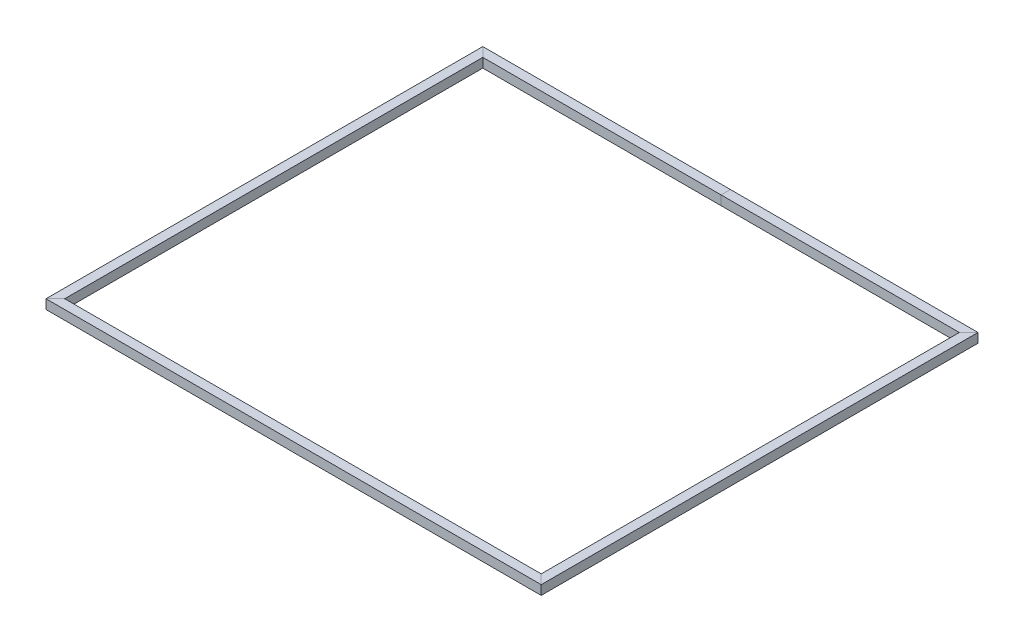
ISO-10303-21;
HEADER;
FILE_DESCRIPTION(('STEP AP214'),'2;1');
FILE_NAME('part.step','',(''),(''),'','','');
FILE_SCHEMA(('AUTOMOTIVE_DESIGN { 1 0 10303 214 1 1 1 1 }'));
ENDSEC;
DATA;
#1=APPLICATION_CONTEXT('core data for automotive mechanical design processes');
#2=APPLICATION_PROTOCOL_DEFINITION('international standard','automotive_design',2000,#1);
#3=PRODUCT_CONTEXT('',#1,'mechanical');
#4=PRODUCT('Part','Part','',(#3));
#5=PRODUCT_RELATED_PRODUCT_CATEGORY('part','',(#4));
#6=PRODUCT_DEFINITION_FORMATION('','',#4);
#7=PRODUCT_DEFINITION_CONTEXT('part definition',#1,'design');
#8=PRODUCT_DEFINITION('design','',#6,#7);
#9=PRODUCT_DEFINITION_SHAPE('','',#8);
#10=(LENGTH_UNIT() NAMED_UNIT(*) SI_UNIT(.MILLI.,.METRE.));
#11=(NAMED_UNIT(*) PLANE_ANGLE_UNIT() SI_UNIT($,.RADIAN.));
#12=(NAMED_UNIT(*) SI_UNIT($,.STERADIAN.) SOLID_ANGLE_UNIT());
#13=UNCERTAINTY_MEASURE_WITH_UNIT(LENGTH_MEASURE(1.E-05),#10,'distance_accuracy_value','');
#14=(GEOMETRIC_REPRESENTATION_CONTEXT(3) GLOBAL_UNCERTAINTY_ASSIGNED_CONTEXT((#13)) GLOBAL_UNIT_ASSIGNED_CONTEXT((#10,
#11,#12)) REPRESENTATION_CONTEXT('',''));
#15=CARTESIAN_POINT('',(0.,0.,0.));
#16=DIRECTION('',(0.,0.,1.));
#17=DIRECTION('',(1.,0.,0.));
#18=AXIS2_PLACEMENT_3D('',#15,#16,#17);
#19=CARTESIAN_POINT('',(1295.4,25.3999999999998,1190.09));
#20=DIRECTION('',(0.,-1.,0.));
#21=DIRECTION('',(1.,0.,0.));
#22=AXIS2_PLACEMENT_3D('',#19,#20,#21);
#23=PLANE('',#22);
#24=DIRECTION('',(0.,0.,-1.));
#25=VECTOR('',#24,1.);
#26=CARTESIAN_POINT('',(1295.4,25.3999999999998,1190.09));
#27=LINE('',#26,#25);
#28=CARTESIAN_POINT('',(1295.4,25.3999999999998,1136.65));
#29=VERTEX_POINT('',#28);
#30=CARTESIAN_POINT('',(1295.4,25.3999999999998,-1136.65));
#31=VERTEX_POINT('',#30);
#32=EDGE_CURVE('E37',#29,#31,#27,.T.);
#33=ORIENTED_EDGE('',*,*,#32,.F.);
#34=DIRECTION('',(0.707106781186548,0.,0.707106781186548));
#35=VECTOR('',#34,1.);
#36=CARTESIAN_POINT('',(-26.7199999999999,25.4,-185.47));
#37=LINE('',#36,#35);
#38=CARTESIAN_POINT('',(1346.2,25.3999999999998,1187.45));
#39=VERTEX_POINT('',#38);
#40=EDGE_CURVE('E238',#29,#39,#37,.T.);
#41=ORIENTED_EDGE('',*,*,#40,.T.);
#42=DIRECTION('',(0.,0.,-1.));
#43=VECTOR('',#42,1.);
#44=CARTESIAN_POINT('',(1346.2,25.3999999999998,1190.09));
#45=LINE('',#44,#43);
#46=CARTESIAN_POINT('',(1346.2,25.3999999999998,-1187.45));
#47=VERTEX_POINT('',#46);
#48=EDGE_CURVE('E224',#39,#47,#45,.T.);
#49=ORIENTED_EDGE('',*,*,#48,.T.);
#50=DIRECTION('',(0.707106781186547,0.,-0.707106781186548));
#51=VECTOR('',#50,1.);
#52=CARTESIAN_POINT('',(1322.12,25.3999999999998,-1163.37));
#53=LINE('',#52,#51);
#54=EDGE_CURVE('E154',#31,#47,#53,.T.);
#55=ORIENTED_EDGE('',*,*,#54,.F.);
#56=EDGE_LOOP('',(#33,#41,#49,#55));
#57=FACE_BOUND('',#56,.T.);
#58=ADVANCED_FACE('F34',(#57),#23,.F.);
#59=CARTESIAN_POINT('',(1346.2,25.3999999999998,1190.09));
#60=DIRECTION('',(-1.,0.,0.));
#61=DIRECTION('',(0.,0.,1.));
#62=AXIS2_PLACEMENT_3D('',#59,#60,#61);
#63=PLANE('',#62);
#64=ORIENTED_EDGE('',*,*,#48,.F.);
#65=DIRECTION('',(0.,-1.,0.));
#66=VECTOR('',#65,1.);
#67=CARTESIAN_POINT('',(1346.2,25.3999999999998,1187.45));
#68=LINE('',#67,#66);
#69=CARTESIAN_POINT('',(1346.2,-25.4000000000002,1187.45));
#70=VERTEX_POINT('',#69);
#71=EDGE_CURVE('E233',#39,#70,#68,.T.);
#72=ORIENTED_EDGE('',*,*,#71,.T.);
#73=DIRECTION('',(0.,0.,-1.));
#74=VECTOR('',#73,1.);
#75=CARTESIAN_POINT('',(1346.2,-25.4000000000002,1190.09));
#76=LINE('',#75,#74);
#77=CARTESIAN_POINT('',(1346.2,-25.4000000000002,-1187.45));
#78=VERTEX_POINT('',#77);
#79=EDGE_CURVE('E182',#70,#78,#76,.T.);
#80=ORIENTED_EDGE('',*,*,#79,.T.);
#81=DIRECTION('',(0.,-1.,0.));
#82=VECTOR('',#81,1.);
#83=CARTESIAN_POINT('',(1346.2,25.3999999999998,-1187.45));
#84=LINE('',#83,#82);
#85=EDGE_CURVE('E170',#47,#78,#84,.T.);
#86=ORIENTED_EDGE('',*,*,#85,.F.);
#87=EDGE_LOOP('',(#64,#72,#80,#86));
#88=FACE_BOUND('',#87,.T.);
#89=ADVANCED_FACE('F231',(#88),#63,.F.);
#90=CARTESIAN_POINT('',(1295.4,-25.4000000000002,1190.09));
#91=DIRECTION('',(0.,1.,0.));
#92=DIRECTION('',(-1.,0.,0.));
#93=AXIS2_PLACEMENT_3D('',#90,#91,#92);
#94=PLANE('',#93);
#95=ORIENTED_EDGE('',*,*,#79,.F.);
#96=DIRECTION('',(-0.707106781186548,0.,-0.707106781186548));
#97=VECTOR('',#96,1.);
#98=CARTESIAN_POINT('',(-26.7199999999999,-25.3999999999999,-185.47));
#99=LINE('',#98,#97);
#100=CARTESIAN_POINT('',(1295.4,-25.4000000000002,1136.65));
#101=VERTEX_POINT('',#100);
#102=EDGE_CURVE('E178',#70,#101,#99,.T.);
#103=ORIENTED_EDGE('',*,*,#102,.T.);
#104=DIRECTION('',(0.,0.,-1.));
#105=VECTOR('',#104,1.);
#106=CARTESIAN_POINT('',(1295.4,-25.4000000000002,1190.09));
#107=LINE('',#106,#105);
#108=CARTESIAN_POINT('',(1295.4,-25.4000000000002,-1136.65));
#109=VERTEX_POINT('',#108);
#110=EDGE_CURVE('E175',#101,#109,#107,.T.);
#111=ORIENTED_EDGE('',*,*,#110,.T.);
#112=DIRECTION('',(-0.707106781186547,0.,0.707106781186548));
#113=VECTOR('',#112,1.);
#114=CARTESIAN_POINT('',(1322.12,-25.4000000000002,-1163.37));
#115=LINE('',#114,#113);
#116=EDGE_CURVE('E160',#78,#109,#115,.T.);
#117=ORIENTED_EDGE('',*,*,#116,.F.);
#118=EDGE_LOOP('',(#95,#103,#111,#117));
#119=FACE_BOUND('',#118,.T.);
#120=ADVANCED_FACE('F177',(#119),#94,.F.);
#121=CARTESIAN_POINT('',(1295.4,25.3999999999998,1190.09));
#122=DIRECTION('',(1.,0.,0.));
#123=DIRECTION('',(0.,0.,-1.));
#124=AXIS2_PLACEMENT_3D('',#121,#122,#123);
#125=PLANE('',#124);
#126=ORIENTED_EDGE('',*,*,#110,.F.);
#127=DIRECTION('',(0.,1.,0.));
#128=VECTOR('',#127,1.);
#129=CARTESIAN_POINT('',(1295.4,25.3999999999998,1136.65));
#130=LINE('',#129,#128);
#131=EDGE_CURVE('E257',#101,#29,#130,.T.);
#132=ORIENTED_EDGE('',*,*,#131,.T.);
#133=ORIENTED_EDGE('',*,*,#32,.T.);
#134=DIRECTION('',(0.,1.,0.));
#135=VECTOR('',#134,1.);
#136=CARTESIAN_POINT('',(1295.4,25.3999999999998,-1136.65));
#137=LINE('',#136,#135);
#138=EDGE_CURVE('E184',#109,#31,#137,.T.);
#139=ORIENTED_EDGE('',*,*,#138,.F.);
#140=EDGE_LOOP('',(#126,#132,#133,#139));
#141=FACE_BOUND('',#140,.T.);
#142=ADVANCED_FACE('F185',(#141),#125,.F.);
#143=CARTESIAN_POINT('',(1348.84,25.3999999999998,-1136.65));
#144=DIRECTION('',(0.,0.,-1.));
#145=DIRECTION('',(-1.,0.,0.));
#146=AXIS2_PLACEMENT_3D('',#143,#144,#145);
#147=PLANE('',#146);
#148=ORIENTED_EDGE('',*,*,#138,.T.);
#149=DIRECTION('',(-1.,0.,0.));
#150=VECTOR('',#149,1.);
#151=CARTESIAN_POINT('',(1348.84,25.3999999999998,-1136.65));
#152=LINE('',#151,#150);
#153=CARTESIAN_POINT('',(0.,25.3999999999998,-1136.65));
#154=VERTEX_POINT('',#153);
#155=EDGE_CURVE('E194',#31,#154,#152,.T.);
#156=ORIENTED_EDGE('',*,*,#155,.T.);
#157=DIRECTION('',(0.,-1.,0.));
#158=VECTOR('',#157,1.);
#159=CARTESIAN_POINT('',(0.,25.3999999999998,-1136.65));
#160=LINE('',#159,#158);
#161=CARTESIAN_POINT('',(0.,-25.4000000000002,-1136.65));
#162=VERTEX_POINT('',#161);
#163=EDGE_CURVE('E193',#154,#162,#160,.T.);
#164=ORIENTED_EDGE('',*,*,#163,.T.);
#165=DIRECTION('',(-1.,0.,0.));
#166=VECTOR('',#165,1.);
#167=CARTESIAN_POINT('',(1348.84,-25.4000000000002,-1136.65));
#168=LINE('',#167,#166);
#169=EDGE_CURVE('E165',#109,#162,#168,.T.);
#170=ORIENTED_EDGE('',*,*,#169,.F.);
#171=EDGE_LOOP('',(#148,#156,#164,#170));
#172=FACE_BOUND('',#171,.T.);
#173=ADVANCED_FACE('F191',(#172),#147,.F.);
#174=CARTESIAN_POINT('',(1348.84,-25.4000000000002,-1136.65));
#175=DIRECTION('',(0.,1.,0.));
#176=DIRECTION('',(0.,0.,1.));
#177=AXIS2_PLACEMENT_3D('',#174,#175,#176);
#178=PLANE('',#177);
#179=ORIENTED_EDGE('',*,*,#116,.T.);
#180=ORIENTED_EDGE('',*,*,#169,.T.);
#181=DIRECTION('',(0.,0.,-1.));
#182=VECTOR('',#181,1.);
#183=CARTESIAN_POINT('',(0.,-25.4000000000002,-1136.65));
#184=LINE('',#183,#182);
#185=CARTESIAN_POINT('',(0.,-25.4000000000002,-1187.45));
#186=VERTEX_POINT('',#185);
#187=EDGE_CURVE('E205',#162,#186,#184,.T.);
#188=ORIENTED_EDGE('',*,*,#187,.T.);
#189=DIRECTION('',(-1.,0.,0.));
#190=VECTOR('',#189,1.);
#191=CARTESIAN_POINT('',(1348.84,-25.4000000000002,-1187.45));
#192=LINE('',#191,#190);
#193=EDGE_CURVE('E167',#78,#186,#192,.T.);
#194=ORIENTED_EDGE('',*,*,#193,.F.);
#195=EDGE_LOOP('',(#179,#180,#188,#194));
#196=FACE_BOUND('',#195,.T.);
#197=ADVANCED_FACE('F162',(#196),#178,.F.);
#198=CARTESIAN_POINT('',(1348.84,25.3999999999998,-1187.45));
#199=DIRECTION('',(0.,0.,1.));
#200=DIRECTION('',(1.,0.,0.));
#201=AXIS2_PLACEMENT_3D('',#198,#199,#200);
#202=PLANE('',#201);
#203=ORIENTED_EDGE('',*,*,#85,.T.);
#204=ORIENTED_EDGE('',*,*,#193,.T.);
#205=DIRECTION('',(0.,1.,0.));
#206=VECTOR('',#205,1.);
#207=CARTESIAN_POINT('',(0.,25.3999999999998,-1187.45));
#208=LINE('',#207,#206);
#209=CARTESIAN_POINT('',(0.,25.3999999999998,-1187.45));
#210=VERTEX_POINT('',#209);
#211=EDGE_CURVE('E207',#186,#210,#208,.T.);
#212=ORIENTED_EDGE('',*,*,#211,.T.);
#213=DIRECTION('',(-1.,0.,0.));
#214=VECTOR('',#213,1.);
#215=CARTESIAN_POINT('',(1348.84,25.3999999999998,-1187.45));
#216=LINE('',#215,#214);
#217=EDGE_CURVE('E196',#47,#210,#216,.T.);
#218=ORIENTED_EDGE('',*,*,#217,.F.);
#219=EDGE_LOOP('',(#203,#204,#212,#218));
#220=FACE_BOUND('',#219,.T.);
#221=ADVANCED_FACE('F526',(#220),#202,.F.);
#222=CARTESIAN_POINT('',(1348.84,25.3999999999998,-1136.65));
#223=DIRECTION('',(0.,-1.,0.));
#224=DIRECTION('',(0.,0.,-1.));
#225=AXIS2_PLACEMENT_3D('',#222,#223,#224);
#226=PLANE('',#225);
#227=ORIENTED_EDGE('',*,*,#54,.T.);
#228=ORIENTED_EDGE('',*,*,#217,.T.);
#229=DIRECTION('',(0.,0.,1.));
#230=VECTOR('',#229,1.);
#231=CARTESIAN_POINT('',(0.,25.3999999999998,-1136.65));
#232=LINE('',#231,#230);
#233=EDGE_CURVE('E210',#210,#154,#232,.T.);
#234=ORIENTED_EDGE('',*,*,#233,.T.);
#235=ORIENTED_EDGE('',*,*,#155,.F.);
#236=EDGE_LOOP('',(#227,#228,#234,#235));
#237=FACE_BOUND('',#236,.T.);
#238=ADVANCED_FACE('F522',(#237),#226,.F.);
#239=CARTESIAN_POINT('',(0.,25.3999999999998,-1136.65));
#240=DIRECTION('',(0.,0.,-1.));
#241=DIRECTION('',(-1.,0.,0.));
#242=AXIS2_PLACEMENT_3D('',#239,#240,#241);
#243=PLANE('',#242);
#244=DIRECTION('',(-1.,0.,0.));
#245=VECTOR('',#244,1.);
#246=CARTESIAN_POINT('',(0.,-25.4000000000002,-1136.65));
#247=LINE('',#246,#245);
#248=CARTESIAN_POINT('',(-1295.4,-25.4000000000002,-1136.65));
#249=VERTEX_POINT('',#248);
#250=EDGE_CURVE('E216',#162,#249,#247,.T.);
#251=ORIENTED_EDGE('',*,*,#250,.F.);
#252=ORIENTED_EDGE('',*,*,#163,.F.);
#253=DIRECTION('',(-1.,0.,0.));
#254=VECTOR('',#253,1.);
#255=CARTESIAN_POINT('',(0.,25.3999999999998,-1136.65));
#256=LINE('',#255,#254);
#257=CARTESIAN_POINT('',(-1295.4,25.3999999999998,-1136.65));
#258=VERTEX_POINT('',#257);
#259=EDGE_CURVE('E213',#154,#258,#256,.T.);
#260=ORIENTED_EDGE('',*,*,#259,.T.);
#261=DIRECTION('',(0.,1.,0.));
#262=VECTOR('',#261,1.);
#263=CARTESIAN_POINT('',(-1295.4,25.3999999999998,-1136.65));
#264=LINE('',#263,#262);
#265=EDGE_CURVE('E276',#249,#258,#264,.T.);
#266=ORIENTED_EDGE('',*,*,#265,.F.);
#267=EDGE_LOOP('',(#251,#252,#260,#266));
#268=FACE_BOUND('',#267,.T.);
#269=ADVANCED_FACE('F525',(#268),#243,.F.);
#270=CARTESIAN_POINT('',(0.,-25.4000000000002,-1136.65));
#271=DIRECTION('',(0.,1.,0.));
#272=DIRECTION('',(0.,0.,1.));
#273=AXIS2_PLACEMENT_3D('',#270,#271,#272);
#274=PLANE('',#273);
#275=DIRECTION('',(-1.,0.,0.));
#276=VECTOR('',#275,1.);
#277=CARTESIAN_POINT('',(0.,-25.4000000000002,-1187.45));
#278=LINE('',#277,#276);
#279=CARTESIAN_POINT('',(-1346.2,-25.4000000000002,-1187.45));
#280=VERTEX_POINT('',#279);
#281=EDGE_CURVE('E219',#186,#280,#278,.T.);
#282=ORIENTED_EDGE('',*,*,#281,.F.);
#283=ORIENTED_EDGE('',*,*,#187,.F.);
#284=ORIENTED_EDGE('',*,*,#250,.T.);
#285=DIRECTION('',(0.707106781186548,0.,0.707106781186548));
#286=VECTOR('',#285,1.);
#287=CARTESIAN_POINT('',(-1322.12,-25.4000000000002,-1163.37));
#288=LINE('',#287,#286);
#289=EDGE_CURVE('E280',#280,#249,#288,.T.);
#290=ORIENTED_EDGE('',*,*,#289,.F.);
#291=EDGE_LOOP('',(#282,#283,#284,#290));
#292=FACE_BOUND('',#291,.T.);
#293=ADVANCED_FACE('F536',(#292),#274,.F.);
#294=CARTESIAN_POINT('',(0.,25.3999999999998,-1187.45));
#295=DIRECTION('',(0.,0.,1.));
#296=DIRECTION('',(1.,0.,0.));
#297=AXIS2_PLACEMENT_3D('',#294,#295,#296);
#298=PLANE('',#297);
#299=DIRECTION('',(-1.,0.,0.));
#300=VECTOR('',#299,1.);
#301=CARTESIAN_POINT('',(0.,25.3999999999998,-1187.45));
#302=LINE('',#301,#300);
#303=CARTESIAN_POINT('',(-1346.2,25.3999999999998,-1187.45));
#304=VERTEX_POINT('',#303);
#305=EDGE_CURVE('E171',#210,#304,#302,.T.);
#306=ORIENTED_EDGE('',*,*,#305,.F.);
#307=ORIENTED_EDGE('',*,*,#211,.F.);
#308=ORIENTED_EDGE('',*,*,#281,.T.);
#309=DIRECTION('',(0.,-1.,0.));
#310=VECTOR('',#309,1.);
#311=CARTESIAN_POINT('',(-1346.2,25.3999999999998,-1187.45));
#312=LINE('',#311,#310);
#313=EDGE_CURVE('E277',#304,#280,#312,.T.);
#314=ORIENTED_EDGE('',*,*,#313,.F.);
#315=EDGE_LOOP('',(#306,#307,#308,#314));
#316=FACE_BOUND('',#315,.T.);
#317=ADVANCED_FACE('F540',(#316),#298,.F.);
#318=CARTESIAN_POINT('',(0.,25.3999999999998,-1136.65));
#319=DIRECTION('',(0.,-1.,0.));
#320=DIRECTION('',(0.,0.,-1.));
#321=AXIS2_PLACEMENT_3D('',#318,#319,#320);
#322=PLANE('',#321);
#323=ORIENTED_EDGE('',*,*,#259,.F.);
#324=ORIENTED_EDGE('',*,*,#233,.F.);
#325=ORIENTED_EDGE('',*,*,#305,.T.);
#326=DIRECTION('',(-0.707106781186548,0.,-0.707106781186548));
#327=VECTOR('',#326,1.);
#328=CARTESIAN_POINT('',(-1322.12,25.3999999999998,-1163.37));
#329=LINE('',#328,#327);
#330=EDGE_CURVE('E261',#258,#304,#329,.T.);
#331=ORIENTED_EDGE('',*,*,#330,.F.);
#332=EDGE_LOOP('',(#323,#324,#325,#331));
#333=FACE_BOUND('',#332,.T.);
#334=ADVANCED_FACE('F520',(#333),#322,.F.);
#335=CARTESIAN_POINT('',(-1348.84,25.3999999999998,1136.65));
#336=DIRECTION('',(0.,-1.,0.));
#337=DIRECTION('',(0.,0.,-1.));
#338=AXIS2_PLACEMENT_3D('',#335,#336,#337);
#339=PLANE('',#338);
#340=DIRECTION('',(1.,0.,0.));
#341=VECTOR('',#340,1.);
#342=CARTESIAN_POINT('',(-1348.84,25.3999999999998,1136.65));
#343=LINE('',#342,#341);
#344=CARTESIAN_POINT('',(-1295.4,25.3999999999998,1136.65));
#345=VERTEX_POINT('',#344);
#346=EDGE_CURVE('E250',#345,#29,#343,.T.);
#347=ORIENTED_EDGE('',*,*,#346,.F.);
#348=DIRECTION('',(-0.707106781186547,0.,0.707106781186548));
#349=VECTOR('',#348,1.);
#350=CARTESIAN_POINT('',(-132.03,25.4,-26.7199999999999));
#351=LINE('',#350,#349);
#352=CARTESIAN_POINT('',(-1346.2,25.3999999999998,1187.45));
#353=VERTEX_POINT('',#352);
#354=EDGE_CURVE('E285',#345,#353,#351,.T.);
#355=ORIENTED_EDGE('',*,*,#354,.T.);
#356=DIRECTION('',(1.,0.,0.));
#357=VECTOR('',#356,1.);
#358=CARTESIAN_POINT('',(-1348.84,25.3999999999998,1187.45));
#359=LINE('',#358,#357);
#360=EDGE_CURVE('E188',#353,#39,#359,.T.);
#361=ORIENTED_EDGE('',*,*,#360,.T.);
#362=ORIENTED_EDGE('',*,*,#40,.F.);
#363=EDGE_LOOP('',(#347,#355,#361,#362));
#364=FACE_BOUND('',#363,.T.);
#365=ADVANCED_FACE('F517',(#364),#339,.F.);
#366=CARTESIAN_POINT('',(-1348.84,25.3999999999998,1187.45));
#367=DIRECTION('',(0.,0.,-1.));
#368=DIRECTION('',(-1.,0.,0.));
#369=AXIS2_PLACEMENT_3D('',#366,#367,#368);
#370=PLANE('',#369);
#371=ORIENTED_EDGE('',*,*,#360,.F.);
#372=DIRECTION('',(0.,-1.,0.));
#373=VECTOR('',#372,1.);
#374=CARTESIAN_POINT('',(-1346.2,25.3999999999998,1187.45));
#375=LINE('',#374,#373);
#376=CARTESIAN_POINT('',(-1346.2,-25.4000000000002,1187.45));
#377=VERTEX_POINT('',#376);
#378=EDGE_CURVE('E244',#353,#377,#375,.T.);
#379=ORIENTED_EDGE('',*,*,#378,.T.);
#380=DIRECTION('',(1.,0.,0.));
#381=VECTOR('',#380,1.);
#382=CARTESIAN_POINT('',(-1348.84,-25.4000000000002,1187.45));
#383=LINE('',#382,#381);
#384=EDGE_CURVE('E242',#377,#70,#383,.T.);
#385=ORIENTED_EDGE('',*,*,#384,.T.);
#386=ORIENTED_EDGE('',*,*,#71,.F.);
#387=EDGE_LOOP('',(#371,#379,#385,#386));
#388=FACE_BOUND('',#387,.T.);
#389=ADVANCED_FACE('F243',(#388),#370,.F.);
#390=CARTESIAN_POINT('',(-1348.84,-25.4000000000002,1136.65));
#391=DIRECTION('',(0.,1.,0.));
#392=DIRECTION('',(0.,0.,1.));
#393=AXIS2_PLACEMENT_3D('',#390,#391,#392);
#394=PLANE('',#393);
#395=ORIENTED_EDGE('',*,*,#384,.F.);
#396=DIRECTION('',(0.707106781186547,0.,-0.707106781186548));
#397=VECTOR('',#396,1.);
#398=CARTESIAN_POINT('',(-132.03,-25.4,-26.7199999999999));
#399=LINE('',#398,#397);
#400=CARTESIAN_POINT('',(-1295.4,-25.4000000000002,1136.65));
#401=VERTEX_POINT('',#400);
#402=EDGE_CURVE('E279',#377,#401,#399,.T.);
#403=ORIENTED_EDGE('',*,*,#402,.T.);
#404=DIRECTION('',(1.,0.,0.));
#405=VECTOR('',#404,1.);
#406=CARTESIAN_POINT('',(-1348.84,-25.4000000000002,1136.65));
#407=LINE('',#406,#405);
#408=EDGE_CURVE('E248',#401,#101,#407,.T.);
#409=ORIENTED_EDGE('',*,*,#408,.T.);
#410=ORIENTED_EDGE('',*,*,#102,.F.);
#411=EDGE_LOOP('',(#395,#403,#409,#410));
#412=FACE_BOUND('',#411,.T.);
#413=ADVANCED_FACE('F511',(#412),#394,.F.);
#414=CARTESIAN_POINT('',(-1348.84,25.3999999999998,1136.65));
#415=DIRECTION('',(0.,0.,1.));
#416=DIRECTION('',(1.,0.,0.));
#417=AXIS2_PLACEMENT_3D('',#414,#415,#416);
#418=PLANE('',#417);
#419=ORIENTED_EDGE('',*,*,#408,.F.);
#420=DIRECTION('',(0.,1.,0.));
#421=VECTOR('',#420,1.);
#422=CARTESIAN_POINT('',(-1295.4,25.3999999999998,1136.65));
#423=LINE('',#422,#421);
#424=EDGE_CURVE('E274',#401,#345,#423,.T.);
#425=ORIENTED_EDGE('',*,*,#424,.T.);
#426=ORIENTED_EDGE('',*,*,#346,.T.);
#427=ORIENTED_EDGE('',*,*,#131,.F.);
#428=EDGE_LOOP('',(#419,#425,#426,#427));
#429=FACE_BOUND('',#428,.T.);
#430=ADVANCED_FACE('F497',(#429),#418,.F.);
#431=CARTESIAN_POINT('',(-1295.4,25.3999999999998,-1190.09));
#432=DIRECTION('',(0.,-1.,0.));
#433=DIRECTION('',(1.,0.,0.));
#434=AXIS2_PLACEMENT_3D('',#431,#432,#433);
#435=PLANE('',#434);
#436=ORIENTED_EDGE('',*,*,#330,.T.);
#437=DIRECTION('',(0.,0.,1.));
#438=VECTOR('',#437,1.);
#439=CARTESIAN_POINT('',(-1346.2,25.3999999999998,-1190.09));
#440=LINE('',#439,#438);
#441=EDGE_CURVE('E271',#304,#353,#440,.T.);
#442=ORIENTED_EDGE('',*,*,#441,.T.);
#443=ORIENTED_EDGE('',*,*,#354,.F.);
#444=DIRECTION('',(0.,0.,1.));
#445=VECTOR('',#444,1.);
#446=CARTESIAN_POINT('',(-1295.4,25.3999999999998,-1190.09));
#447=LINE('',#446,#445);
#448=EDGE_CURVE('E262',#258,#345,#447,.T.);
#449=ORIENTED_EDGE('',*,*,#448,.F.);
#450=EDGE_LOOP('',(#436,#442,#443,#449));
#451=FACE_BOUND('',#450,.T.);
#452=ADVANCED_FACE('F493',(#451),#435,.F.);
#453=CARTESIAN_POINT('',(-1346.2,25.3999999999998,-1190.09));
#454=DIRECTION('',(1.,0.,0.));
#455=DIRECTION('',(0.,0.,-1.));
#456=AXIS2_PLACEMENT_3D('',#453,#454,#455);
#457=PLANE('',#456);
#458=ORIENTED_EDGE('',*,*,#313,.T.);
#459=DIRECTION('',(0.,0.,1.));
#460=VECTOR('',#459,1.);
#461=CARTESIAN_POINT('',(-1346.2,-25.4000000000002,-1190.09));
#462=LINE('',#461,#460);
#463=EDGE_CURVE('E269',#280,#377,#462,.T.);
#464=ORIENTED_EDGE('',*,*,#463,.T.);
#465=ORIENTED_EDGE('',*,*,#378,.F.);
#466=ORIENTED_EDGE('',*,*,#441,.F.);
#467=EDGE_LOOP('',(#458,#464,#465,#466));
#468=FACE_BOUND('',#467,.T.);
#469=ADVANCED_FACE('F496',(#468),#457,.F.);
#470=CARTESIAN_POINT('',(-1295.4,-25.4000000000002,-1190.09));
#471=DIRECTION('',(0.,1.,0.));
#472=DIRECTION('',(-1.,0.,0.));
#473=AXIS2_PLACEMENT_3D('',#470,#471,#472);
#474=PLANE('',#473);
#475=ORIENTED_EDGE('',*,*,#289,.T.);
#476=DIRECTION('',(0.,0.,1.));
#477=VECTOR('',#476,1.);
#478=CARTESIAN_POINT('',(-1295.4,-25.4000000000002,-1190.09));
#479=LINE('',#478,#477);
#480=EDGE_CURVE('E266',#249,#401,#479,.T.);
#481=ORIENTED_EDGE('',*,*,#480,.T.);
#482=ORIENTED_EDGE('',*,*,#402,.F.);
#483=ORIENTED_EDGE('',*,*,#463,.F.);
#484=EDGE_LOOP('',(#475,#481,#482,#483));
#485=FACE_BOUND('',#484,.T.);
#486=ADVANCED_FACE('F501',(#485),#474,.F.);
#487=CARTESIAN_POINT('',(-1295.4,25.3999999999998,-1190.09));
#488=DIRECTION('',(-1.,0.,0.));
#489=DIRECTION('',(0.,0.,1.));
#490=AXIS2_PLACEMENT_3D('',#487,#488,#489);
#491=PLANE('',#490);
#492=ORIENTED_EDGE('',*,*,#265,.T.);
#493=ORIENTED_EDGE('',*,*,#448,.T.);
#494=ORIENTED_EDGE('',*,*,#424,.F.);
#495=ORIENTED_EDGE('',*,*,#480,.F.);
#496=EDGE_LOOP('',(#492,#493,#494,#495));
#497=FACE_BOUND('',#496,.T.);
#498=ADVANCED_FACE('F505',(#497),#491,.F.);
#499=CLOSED_SHELL('',(#58,#89,#120,#142,#173,#197,#221,#238,#269,#293,#317,#334,#365,#389,#413,
#430,#452,#469,#486,#498));
#500=CARTESIAN_POINT('',(1344.6125,23.8124999999998,1188.34375));
#501=DIRECTION('',(1.,0.,0.));
#502=DIRECTION('',(0.,0.,-1.));
#503=AXIS2_PLACEMENT_3D('',#500,#501,#502);
#504=PLANE('',#503);
#505=DIRECTION('',(0.,0.,-1.));
#506=VECTOR('',#505,1.);
#507=CARTESIAN_POINT('',(1344.6125,-23.8125000000003,1188.34375));
#508=LINE('',#507,#506);
#509=CARTESIAN_POINT('',(1344.6125,-23.8125000000003,1185.8625));
#510=VERTEX_POINT('',#509);
#511=CARTESIAN_POINT('',(1344.6125,-23.8125000000003,-1185.8625));
#512=VERTEX_POINT('',#511);
#513=EDGE_CURVE('E290',#510,#512,#508,.T.);
#514=ORIENTED_EDGE('',*,*,#513,.F.);
#515=DIRECTION('',(0.,1.,0.));
#516=VECTOR('',#515,1.);
#517=CARTESIAN_POINT('',(1344.6125,23.8124999999998,1185.8625));
#518=LINE('',#517,#516);
#519=CARTESIAN_POINT('',(1344.6125,23.8124999999998,1185.8625));
#520=VERTEX_POINT('',#519);
#521=EDGE_CURVE('E345',#510,#520,#518,.T.);
#522=ORIENTED_EDGE('',*,*,#521,.T.);
#523=DIRECTION('',(0.,0.,-1.));
#524=VECTOR('',#523,1.);
#525=CARTESIAN_POINT('',(1344.6125,23.8124999999998,1188.34375));
#526=LINE('',#525,#524);
#527=CARTESIAN_POINT('',(1344.6125,23.8124999999998,-1185.8625));
#528=VERTEX_POINT('',#527);
#529=EDGE_CURVE('E265',#520,#528,#526,.T.);
#530=ORIENTED_EDGE('',*,*,#529,.T.);
#531=DIRECTION('',(0.,1.,0.));
#532=VECTOR('',#531,1.);
#533=CARTESIAN_POINT('',(1344.6125,23.8124999999998,-1185.8625));
#534=LINE('',#533,#532);
#535=EDGE_CURVE('E329',#512,#528,#534,.T.);
#536=ORIENTED_EDGE('',*,*,#535,.F.);
#537=EDGE_LOOP('',(#514,#522,#530,#536));
#538=FACE_BOUND('',#537,.T.);
#539=ADVANCED_FACE('F460',(#538),#504,.F.);
#540=CARTESIAN_POINT('',(1296.9875,23.8124999999998,1188.34375));
#541=DIRECTION('',(0.,1.,0.));
#542=DIRECTION('',(-1.,0.,0.));
#543=AXIS2_PLACEMENT_3D('',#540,#541,#542);
#544=PLANE('',#543);
#545=ORIENTED_EDGE('',*,*,#529,.F.);
#546=DIRECTION('',(-0.707106781186548,0.,-0.707106781186548));
#547=VECTOR('',#546,1.);
#548=CARTESIAN_POINT('',(-25.0531250000001,23.8125000000001,-183.803125));
#549=LINE('',#548,#547);
#550=CARTESIAN_POINT('',(1296.9875,23.8124999999998,1138.2375));
#551=VERTEX_POINT('',#550);
#552=EDGE_CURVE('E357',#520,#551,#549,.T.);
#553=ORIENTED_EDGE('',*,*,#552,.T.);
#554=DIRECTION('',(0.,0.,-1.));
#555=VECTOR('',#554,1.);
#556=CARTESIAN_POINT('',(1296.9875,23.8124999999998,1188.34375));
#557=LINE('',#556,#555);
#558=CARTESIAN_POINT('',(1296.9875,23.8124999999998,-1138.2375));
#559=VERTEX_POINT('',#558);
#560=EDGE_CURVE('E295',#551,#559,#557,.T.);
#561=ORIENTED_EDGE('',*,*,#560,.T.);
#562=DIRECTION('',(-0.707106781186547,0.,0.707106781186548));
#563=VECTOR('',#562,1.);
#564=CARTESIAN_POINT('',(1322.040625,23.8124999999998,-1163.290625));
#565=LINE('',#564,#563);
#566=EDGE_CURVE('E326',#528,#559,#565,.T.);
#567=ORIENTED_EDGE('',*,*,#566,.F.);
#568=EDGE_LOOP('',(#545,#553,#561,#567));
#569=FACE_BOUND('',#568,.T.);
#570=ADVANCED_FACE('F457',(#569),#544,.F.);
#571=CARTESIAN_POINT('',(1296.9875,23.8124999999998,1188.34375));
#572=DIRECTION('',(-1.,0.,0.));
#573=DIRECTION('',(0.,0.,1.));
#574=AXIS2_PLACEMENT_3D('',#571,#572,#573);
#575=PLANE('',#574);
#576=ORIENTED_EDGE('',*,*,#560,.F.);
#577=DIRECTION('',(0.,-1.,0.));
#578=VECTOR('',#577,1.);
#579=CARTESIAN_POINT('',(1296.9875,23.8124999999998,1138.2375));
#580=LINE('',#579,#578);
#581=CARTESIAN_POINT('',(1296.9875,-23.8125000000003,1138.2375));
#582=VERTEX_POINT('',#581);
#583=EDGE_CURVE('E360',#551,#582,#580,.T.);
#584=ORIENTED_EDGE('',*,*,#583,.T.);
#585=DIRECTION('',(0.,0.,-1.));
#586=VECTOR('',#585,1.);
#587=CARTESIAN_POINT('',(1296.9875,-23.8125000000003,1188.34375));
#588=LINE('',#587,#586);
#589=CARTESIAN_POINT('',(1296.9875,-23.8125000000003,-1138.2375));
#590=VERTEX_POINT('',#589);
#591=EDGE_CURVE('E293',#582,#590,#588,.T.);
#592=ORIENTED_EDGE('',*,*,#591,.T.);
#593=DIRECTION('',(0.,-1.,0.));
#594=VECTOR('',#593,1.);
#595=CARTESIAN_POINT('',(1296.9875,23.8124999999998,-1138.2375));
#596=LINE('',#595,#594);
#597=EDGE_CURVE('E301',#559,#590,#596,.T.);
#598=ORIENTED_EDGE('',*,*,#597,.F.);
#599=EDGE_LOOP('',(#576,#584,#592,#598));
#600=FACE_BOUND('',#599,.T.);
#601=ADVANCED_FACE('F437',(#600),#575,.F.);
#602=CARTESIAN_POINT('',(1296.9875,-23.8125000000003,1188.34375));
#603=DIRECTION('',(0.,-1.,0.));
#604=DIRECTION('',(1.,0.,0.));
#605=AXIS2_PLACEMENT_3D('',#602,#603,#604);
#606=PLANE('',#605);
#607=ORIENTED_EDGE('',*,*,#591,.F.);
#608=DIRECTION('',(0.707106781186548,0.,0.707106781186548));
#609=VECTOR('',#608,1.);
#610=CARTESIAN_POINT('',(-25.0531250000001,-23.8125,-183.803125));
#611=LINE('',#610,#609);
#612=EDGE_CURVE('E342',#582,#510,#611,.T.);
#613=ORIENTED_EDGE('',*,*,#612,.T.);
#614=ORIENTED_EDGE('',*,*,#513,.T.);
#615=DIRECTION('',(0.707106781186547,0.,-0.707106781186548));
#616=VECTOR('',#615,1.);
#617=CARTESIAN_POINT('',(1322.040625,-23.8125000000003,-1163.290625));
#618=LINE('',#617,#616);
#619=EDGE_CURVE('E332',#590,#512,#618,.T.);
#620=ORIENTED_EDGE('',*,*,#619,.F.);
#621=EDGE_LOOP('',(#607,#613,#614,#620));
#622=FACE_BOUND('',#621,.T.);
#623=ADVANCED_FACE('F441',(#622),#606,.F.);
#624=CARTESIAN_POINT('',(1347.09375,-23.8125000000003,-1138.2375));
#625=DIRECTION('',(0.,-1.,0.));
#626=DIRECTION('',(0.,0.,-1.));
#627=AXIS2_PLACEMENT_3D('',#624,#625,#626);
#628=PLANE('',#627);
#629=ORIENTED_EDGE('',*,*,#619,.T.);
#630=DIRECTION('',(-1.,0.,0.));
#631=VECTOR('',#630,1.);
#632=CARTESIAN_POINT('',(1347.09375,-23.8125000000003,-1185.8625));
#633=LINE('',#632,#631);
#634=CARTESIAN_POINT('',(0.,-23.8125000000003,-1185.8625));
#635=VERTEX_POINT('',#634);
#636=EDGE_CURVE('E292',#512,#635,#633,.T.);
#637=ORIENTED_EDGE('',*,*,#636,.T.);
#638=DIRECTION('',(0.,0.,-1.));
#639=VECTOR('',#638,1.);
#640=CARTESIAN_POINT('',(0.,-23.8125000000003,-1138.2375));
#641=LINE('',#640,#639);
#642=CARTESIAN_POINT('',(0.,-23.8125000000003,-1138.2375));
#643=VERTEX_POINT('',#642);
#644=EDGE_CURVE('E320',#635,#643,#641,.F.);
#645=ORIENTED_EDGE('',*,*,#644,.T.);
#646=DIRECTION('',(-1.,0.,0.));
#647=VECTOR('',#646,1.);
#648=CARTESIAN_POINT('',(1347.09375,-23.8125000000003,-1138.2375));
#649=LINE('',#648,#647);
#650=EDGE_CURVE('E339',#590,#643,#649,.T.);
#651=ORIENTED_EDGE('',*,*,#650,.F.);
#652=EDGE_LOOP('',(#629,#637,#645,#651));
#653=FACE_BOUND('',#652,.T.);
#654=ADVANCED_FACE('F445',(#653),#628,.F.);
#655=CARTESIAN_POINT('',(1347.09375,23.8124999999998,-1138.2375));
#656=DIRECTION('',(0.,0.,1.));
#657=DIRECTION('',(1.,0.,0.));
#658=AXIS2_PLACEMENT_3D('',#655,#656,#657);
#659=PLANE('',#658);
#660=ORIENTED_EDGE('',*,*,#597,.T.);
#661=ORIENTED_EDGE('',*,*,#650,.T.);
#662=DIRECTION('',(0.,-1.,0.));
#663=VECTOR('',#662,1.);
#664=CARTESIAN_POINT('',(0.,23.8124999999998,-1138.2375));
#665=LINE('',#664,#663);
#666=CARTESIAN_POINT('',(0.,23.8124999999998,-1138.2375));
#667=VERTEX_POINT('',#666);
#668=EDGE_CURVE('E317',#643,#667,#665,.F.);
#669=ORIENTED_EDGE('',*,*,#668,.T.);
#670=DIRECTION('',(-1.,0.,0.));
#671=VECTOR('',#670,1.);
#672=CARTESIAN_POINT('',(1347.09375,23.8124999999998,-1138.2375));
#673=LINE('',#672,#671);
#674=EDGE_CURVE('E337',#559,#667,#673,.T.);
#675=ORIENTED_EDGE('',*,*,#674,.F.);
#676=EDGE_LOOP('',(#660,#661,#669,#675));
#677=FACE_BOUND('',#676,.T.);
#678=ADVANCED_FACE('F449',(#677),#659,.F.);
#679=CARTESIAN_POINT('',(1347.09375,23.8124999999998,-1138.2375));
#680=DIRECTION('',(0.,1.,0.));
#681=DIRECTION('',(0.,0.,1.));
#682=AXIS2_PLACEMENT_3D('',#679,#680,#681);
#683=PLANE('',#682);
#684=ORIENTED_EDGE('',*,*,#566,.T.);
#685=ORIENTED_EDGE('',*,*,#674,.T.);
#686=DIRECTION('',(0.,0.,1.));
#687=VECTOR('',#686,1.);
#688=CARTESIAN_POINT('',(0.,23.8124999999998,-1138.2375));
#689=LINE('',#688,#687);
#690=CARTESIAN_POINT('',(0.,23.8124999999998,-1185.8625));
#691=VERTEX_POINT('',#690);
#692=EDGE_CURVE('E314',#667,#691,#689,.F.);
#693=ORIENTED_EDGE('',*,*,#692,.T.);
#694=DIRECTION('',(-1.,0.,0.));
#695=VECTOR('',#694,1.);
#696=CARTESIAN_POINT('',(1347.09375,23.8124999999998,-1185.8625));
#697=LINE('',#696,#695);
#698=EDGE_CURVE('E323',#528,#691,#697,.T.);
#699=ORIENTED_EDGE('',*,*,#698,.F.);
#700=EDGE_LOOP('',(#684,#685,#693,#699));
#701=FACE_BOUND('',#700,.T.);
#702=ADVANCED_FACE('F455',(#701),#683,.F.);
#703=CARTESIAN_POINT('',(1347.09375,23.8124999999998,-1185.8625));
#704=DIRECTION('',(0.,0.,-1.));
#705=DIRECTION('',(-1.,0.,0.));
#706=AXIS2_PLACEMENT_3D('',#703,#704,#705);
#707=PLANE('',#706);
#708=ORIENTED_EDGE('',*,*,#535,.T.);
#709=ORIENTED_EDGE('',*,*,#698,.T.);
#710=DIRECTION('',(0.,1.,0.));
#711=VECTOR('',#710,1.);
#712=CARTESIAN_POINT('',(0.,23.8124999999998,-1185.8625));
#713=LINE('',#712,#711);
#714=EDGE_CURVE('E311',#691,#635,#713,.F.);
#715=ORIENTED_EDGE('',*,*,#714,.T.);
#716=ORIENTED_EDGE('',*,*,#636,.F.);
#717=EDGE_LOOP('',(#708,#709,#715,#716));
#718=FACE_BOUND('',#717,.T.);
#719=ADVANCED_FACE('F462',(#718),#707,.F.);
#720=CARTESIAN_POINT('',(0.,-23.8125000000003,-1138.2375));
#721=DIRECTION('',(0.,-1.,0.));
#722=DIRECTION('',(0.,0.,-1.));
#723=AXIS2_PLACEMENT_3D('',#720,#721,#722);
#724=PLANE('',#723);
#725=DIRECTION('',(-1.,0.,0.));
#726=VECTOR('',#725,1.);
#727=CARTESIAN_POINT('',(0.,-23.8125000000003,-1138.2375));
#728=LINE('',#727,#726);
#729=CARTESIAN_POINT('',(-1296.9875,-23.8125000000003,-1138.2375));
#730=VERTEX_POINT('',#729);
#731=EDGE_CURVE('E305',#643,#730,#728,.T.);
#732=ORIENTED_EDGE('',*,*,#731,.F.);
#733=ORIENTED_EDGE('',*,*,#644,.F.);
#734=DIRECTION('',(-1.,0.,0.));
#735=VECTOR('',#734,1.);
#736=CARTESIAN_POINT('',(0.,-23.8125000000003,-1185.8625));
#737=LINE('',#736,#735);
#738=CARTESIAN_POINT('',(-1344.6125,-23.8125000000003,-1185.8625));
#739=VERTEX_POINT('',#738);
#740=EDGE_CURVE('E308',#635,#739,#737,.T.);
#741=ORIENTED_EDGE('',*,*,#740,.T.);
#742=DIRECTION('',(-0.707106781186547,0.,-0.707106781186547));
#743=VECTOR('',#742,1.);
#744=CARTESIAN_POINT('',(-1322.040625,-23.8125000000003,-1163.290625));
#745=LINE('',#744,#743);
#746=EDGE_CURVE('E375',#730,#739,#745,.T.);
#747=ORIENTED_EDGE('',*,*,#746,.F.);
#748=EDGE_LOOP('',(#732,#733,#741,#747));
#749=FACE_BOUND('',#748,.T.);
#750=ADVANCED_FACE('F464',(#749),#724,.F.);
#751=CARTESIAN_POINT('',(0.,23.8124999999998,-1138.2375));
#752=DIRECTION('',(0.,0.,1.));
#753=DIRECTION('',(1.,0.,0.));
#754=AXIS2_PLACEMENT_3D('',#751,#752,#753);
#755=PLANE('',#754);
#756=DIRECTION('',(-1.,0.,0.));
#757=VECTOR('',#756,1.);
#758=CARTESIAN_POINT('',(0.,23.8124999999998,-1138.2375));
#759=LINE('',#758,#757);
#760=CARTESIAN_POINT('',(-1296.9875,23.8124999999998,-1138.2375));
#761=VERTEX_POINT('',#760);
#762=EDGE_CURVE('E302',#667,#761,#759,.T.);
#763=ORIENTED_EDGE('',*,*,#762,.F.);
#764=ORIENTED_EDGE('',*,*,#668,.F.);
#765=ORIENTED_EDGE('',*,*,#731,.T.);
#766=DIRECTION('',(0.,-1.,0.));
#767=VECTOR('',#766,1.);
#768=CARTESIAN_POINT('',(-1296.9875,23.8124999999998,-1138.2375));
#769=LINE('',#768,#767);
#770=EDGE_CURVE('E380',#761,#730,#769,.T.);
#771=ORIENTED_EDGE('',*,*,#770,.F.);
#772=EDGE_LOOP('',(#763,#764,#765,#771));
#773=FACE_BOUND('',#772,.T.);
#774=ADVANCED_FACE('F466',(#773),#755,.F.);
#775=CARTESIAN_POINT('',(0.,23.8124999999998,-1138.2375));
#776=DIRECTION('',(0.,1.,0.));
#777=DIRECTION('',(0.,0.,1.));
#778=AXIS2_PLACEMENT_3D('',#775,#776,#777);
#779=PLANE('',#778);
#780=DIRECTION('',(-1.,0.,0.));
#781=VECTOR('',#780,1.);
#782=CARTESIAN_POINT('',(0.,23.8124999999998,-1185.8625));
#783=LINE('',#782,#781);
#784=CARTESIAN_POINT('',(-1344.6125,23.8124999999998,-1185.8625));
#785=VERTEX_POINT('',#784);
#786=EDGE_CURVE('E298',#691,#785,#783,.T.);
#787=ORIENTED_EDGE('',*,*,#786,.F.);
#788=ORIENTED_EDGE('',*,*,#692,.F.);
#789=ORIENTED_EDGE('',*,*,#762,.T.);
#790=DIRECTION('',(0.707106781186547,0.,0.707106781186547));
#791=VECTOR('',#790,1.);
#792=CARTESIAN_POINT('',(-1322.040625,23.8124999999998,-1163.290625));
#793=LINE('',#792,#791);
#794=EDGE_CURVE('E376',#785,#761,#793,.T.);
#795=ORIENTED_EDGE('',*,*,#794,.F.);
#796=EDGE_LOOP('',(#787,#788,#789,#795));
#797=FACE_BOUND('',#796,.T.);
#798=ADVANCED_FACE('F470',(#797),#779,.F.);
#799=CARTESIAN_POINT('',(0.,23.8124999999998,-1185.8625));
#800=DIRECTION('',(0.,0.,-1.));
#801=DIRECTION('',(-1.,0.,0.));
#802=AXIS2_PLACEMENT_3D('',#799,#800,#801);
#803=PLANE('',#802);
#804=ORIENTED_EDGE('',*,*,#740,.F.);
#805=ORIENTED_EDGE('',*,*,#714,.F.);
#806=ORIENTED_EDGE('',*,*,#786,.T.);
#807=DIRECTION('',(0.,1.,0.));
#808=VECTOR('',#807,1.);
#809=CARTESIAN_POINT('',(-1344.6125,23.8124999999998,-1185.8625));
#810=LINE('',#809,#808);
#811=EDGE_CURVE('E362',#739,#785,#810,.T.);
#812=ORIENTED_EDGE('',*,*,#811,.F.);
#813=EDGE_LOOP('',(#804,#805,#806,#812));
#814=FACE_BOUND('',#813,.T.);
#815=ADVANCED_FACE('F472',(#814),#803,.F.);
#816=CARTESIAN_POINT('',(-1347.09375,23.8124999999998,1185.8625));
#817=DIRECTION('',(0.,0.,1.));
#818=DIRECTION('',(1.,0.,0.));
#819=AXIS2_PLACEMENT_3D('',#816,#817,#818);
#820=PLANE('',#819);
#821=DIRECTION('',(1.,0.,0.));
#822=VECTOR('',#821,1.);
#823=CARTESIAN_POINT('',(-1347.09375,-23.8125000000003,1185.8625));
#824=LINE('',#823,#822);
#825=CARTESIAN_POINT('',(-1344.6125,-23.8125000000003,1185.8625));
#826=VERTEX_POINT('',#825);
#827=EDGE_CURVE('E346',#826,#510,#824,.T.);
#828=ORIENTED_EDGE('',*,*,#827,.F.);
#829=DIRECTION('',(0.,1.,0.));
#830=VECTOR('',#829,1.);
#831=CARTESIAN_POINT('',(-1344.6125,23.8124999999998,1185.8625));
#832=LINE('',#831,#830);
#833=CARTESIAN_POINT('',(-1344.6125,23.8124999999998,1185.8625));
#834=VERTEX_POINT('',#833);
#835=EDGE_CURVE('E389',#826,#834,#832,.T.);
#836=ORIENTED_EDGE('',*,*,#835,.T.);
#837=DIRECTION('',(1.,0.,0.));
#838=VECTOR('',#837,1.);
#839=CARTESIAN_POINT('',(-1347.09375,23.8124999999998,1185.8625));
#840=LINE('',#839,#838);
#841=EDGE_CURVE('E335',#834,#520,#840,.T.);
#842=ORIENTED_EDGE('',*,*,#841,.T.);
#843=ORIENTED_EDGE('',*,*,#521,.F.);
#844=EDGE_LOOP('',(#828,#836,#842,#843));
#845=FACE_BOUND('',#844,.T.);
#846=ADVANCED_FACE('F424',(#845),#820,.F.);
#847=CARTESIAN_POINT('',(-1347.09375,23.8124999999998,1138.2375));
#848=DIRECTION('',(0.,1.,0.));
#849=DIRECTION('',(0.,0.,1.));
#850=AXIS2_PLACEMENT_3D('',#847,#848,#849);
#851=PLANE('',#850);
#852=ORIENTED_EDGE('',*,*,#841,.F.);
#853=DIRECTION('',(0.707106781186547,0.,-0.707106781186548));
#854=VECTOR('',#853,1.);
#855=CARTESIAN_POINT('',(-133.696875,23.8125,-25.0531249999997));
#856=LINE('',#855,#854);
#857=CARTESIAN_POINT('',(-1296.9875,23.8124999999998,1138.2375));
#858=VERTEX_POINT('',#857);
#859=EDGE_CURVE('E386',#834,#858,#856,.T.);
#860=ORIENTED_EDGE('',*,*,#859,.T.);
#861=DIRECTION('',(1.,0.,0.));
#862=VECTOR('',#861,1.);
#863=CARTESIAN_POINT('',(-1347.09375,23.8124999999998,1138.2375));
#864=LINE('',#863,#862);
#865=EDGE_CURVE('E350',#858,#551,#864,.T.);
#866=ORIENTED_EDGE('',*,*,#865,.T.);
#867=ORIENTED_EDGE('',*,*,#552,.F.);
#868=EDGE_LOOP('',(#852,#860,#866,#867));
#869=FACE_BOUND('',#868,.T.);
#870=ADVANCED_FACE('F420',(#869),#851,.F.);
#871=CARTESIAN_POINT('',(-1347.09375,23.8124999999998,1138.2375));
#872=DIRECTION('',(0.,0.,-1.));
#873=DIRECTION('',(-1.,0.,0.));
#874=AXIS2_PLACEMENT_3D('',#871,#872,#873);
#875=PLANE('',#874);
#876=ORIENTED_EDGE('',*,*,#865,.F.);
#877=DIRECTION('',(0.,-1.,0.));
#878=VECTOR('',#877,1.);
#879=CARTESIAN_POINT('',(-1296.9875,23.8124999999998,1138.2375));
#880=LINE('',#879,#878);
#881=CARTESIAN_POINT('',(-1296.9875,-23.8125000000003,1138.2375));
#882=VERTEX_POINT('',#881);
#883=EDGE_CURVE('E379',#858,#882,#880,.T.);
#884=ORIENTED_EDGE('',*,*,#883,.T.);
#885=DIRECTION('',(1.,0.,0.));
#886=VECTOR('',#885,1.);
#887=CARTESIAN_POINT('',(-1347.09375,-23.8125000000003,1138.2375));
#888=LINE('',#887,#886);
#889=EDGE_CURVE('E52',#882,#582,#888,.T.);
#890=ORIENTED_EDGE('',*,*,#889,.T.);
#891=ORIENTED_EDGE('',*,*,#583,.F.);
#892=EDGE_LOOP('',(#876,#884,#890,#891));
#893=FACE_BOUND('',#892,.T.);
#894=ADVANCED_FACE('F434',(#893),#875,.F.);
#895=CARTESIAN_POINT('',(-1347.09375,-23.8125000000003,1138.2375));
#896=DIRECTION('',(0.,-1.,0.));
#897=DIRECTION('',(0.,0.,-1.));
#898=AXIS2_PLACEMENT_3D('',#895,#896,#897);
#899=PLANE('',#898);
#900=ORIENTED_EDGE('',*,*,#889,.F.);
#901=DIRECTION('',(-0.707106781186547,0.,0.707106781186548));
#902=VECTOR('',#901,1.);
#903=CARTESIAN_POINT('',(-133.696875,-23.8125,-25.0531249999997));
#904=LINE('',#903,#902);
#905=EDGE_CURVE('E372',#882,#826,#904,.T.);
#906=ORIENTED_EDGE('',*,*,#905,.T.);
#907=ORIENTED_EDGE('',*,*,#827,.T.);
#908=ORIENTED_EDGE('',*,*,#612,.F.);
#909=EDGE_LOOP('',(#900,#906,#907,#908));
#910=FACE_BOUND('',#909,.T.);
#911=ADVANCED_FACE('F393',(#910),#899,.F.);
#912=CARTESIAN_POINT('',(-1344.6125,23.8124999999998,-1188.34375));
#913=DIRECTION('',(-1.,0.,0.));
#914=DIRECTION('',(0.,0.,1.));
#915=AXIS2_PLACEMENT_3D('',#912,#913,#914);
#916=PLANE('',#915);
#917=ORIENTED_EDGE('',*,*,#811,.T.);
#918=DIRECTION('',(0.,0.,1.));
#919=VECTOR('',#918,1.);
#920=CARTESIAN_POINT('',(-1344.6125,23.8124999999998,-1188.34375));
#921=LINE('',#920,#919);
#922=EDGE_CURVE('E369',#785,#834,#921,.T.);
#923=ORIENTED_EDGE('',*,*,#922,.T.);
#924=ORIENTED_EDGE('',*,*,#835,.F.);
#925=DIRECTION('',(0.,0.,1.));
#926=VECTOR('',#925,1.);
#927=CARTESIAN_POINT('',(-1344.6125,-23.8125000000003,-1188.34375));
#928=LINE('',#927,#926);
#929=EDGE_CURVE('E11',#739,#826,#928,.T.);
#930=ORIENTED_EDGE('',*,*,#929,.F.);
#931=EDGE_LOOP('',(#917,#923,#924,#930));
#932=FACE_BOUND('',#931,.T.);
#933=ADVANCED_FACE('F401',(#932),#916,.F.);
#934=CARTESIAN_POINT('',(-1296.9875,23.8124999999998,-1188.34375));
#935=DIRECTION('',(0.,1.,0.));
#936=DIRECTION('',(-1.,0.,0.));
#937=AXIS2_PLACEMENT_3D('',#934,#935,#936);
#938=PLANE('',#937);
#939=ORIENTED_EDGE('',*,*,#794,.T.);
#940=DIRECTION('',(0.,0.,1.));
#941=VECTOR('',#940,1.);
#942=CARTESIAN_POINT('',(-1296.9875,23.8124999999998,-1188.34375));
#943=LINE('',#942,#941);
#944=EDGE_CURVE('E366',#761,#858,#943,.T.);
#945=ORIENTED_EDGE('',*,*,#944,.T.);
#946=ORIENTED_EDGE('',*,*,#859,.F.);
#947=ORIENTED_EDGE('',*,*,#922,.F.);
#948=EDGE_LOOP('',(#939,#945,#946,#947));
#949=FACE_BOUND('',#948,.T.);
#950=ADVANCED_FACE('F427',(#949),#938,.F.);
#951=CARTESIAN_POINT('',(-1296.9875,23.8124999999998,-1188.34375));
#952=DIRECTION('',(1.,0.,0.));
#953=DIRECTION('',(0.,0.,-1.));
#954=AXIS2_PLACEMENT_3D('',#951,#952,#953);
#955=PLANE('',#954);
#956=ORIENTED_EDGE('',*,*,#770,.T.);
#957=DIRECTION('',(0.,0.,1.));
#958=VECTOR('',#957,1.);
#959=CARTESIAN_POINT('',(-1296.9875,-23.8125000000003,-1188.34375));
#960=LINE('',#959,#958);
#961=EDGE_CURVE('E43',#730,#882,#960,.T.);
#962=ORIENTED_EDGE('',*,*,#961,.T.);
#963=ORIENTED_EDGE('',*,*,#883,.F.);
#964=ORIENTED_EDGE('',*,*,#944,.F.);
#965=EDGE_LOOP('',(#956,#962,#963,#964));
#966=FACE_BOUND('',#965,.T.);
#967=ADVANCED_FACE('F432',(#966),#955,.F.);
#968=CARTESIAN_POINT('',(-1296.9875,-23.8125000000003,-1188.34375));
#969=DIRECTION('',(0.,-1.,0.));
#970=DIRECTION('',(1.,0.,0.));
#971=AXIS2_PLACEMENT_3D('',#968,#969,#970);
#972=PLANE('',#971);
#973=ORIENTED_EDGE('',*,*,#746,.T.);
#974=ORIENTED_EDGE('',*,*,#929,.T.);
#975=ORIENTED_EDGE('',*,*,#905,.F.);
#976=ORIENTED_EDGE('',*,*,#961,.F.);
#977=EDGE_LOOP('',(#973,#974,#975,#976));
#978=FACE_BOUND('',#977,.T.);
#979=ADVANCED_FACE('F397',(#978),#972,.F.);
#980=CLOSED_SHELL('',(#539,#570,#601,#623,#654,#678,#702,#719,#750,#774,#798,#815,#846,#870,
#894,#911,#933,#950,#967,#979));
#981=ORIENTED_CLOSED_SHELL('',*,#980,.T.);
#982=BREP_WITH_VOIDS('B2',#499,(#981));
#983=ADVANCED_BREP_SHAPE_REPRESENTATION('',(#18,#982),#14);
#984=SHAPE_DEFINITION_REPRESENTATION(#9,#983);
ENDSEC;
END-ISO-10303-21;
